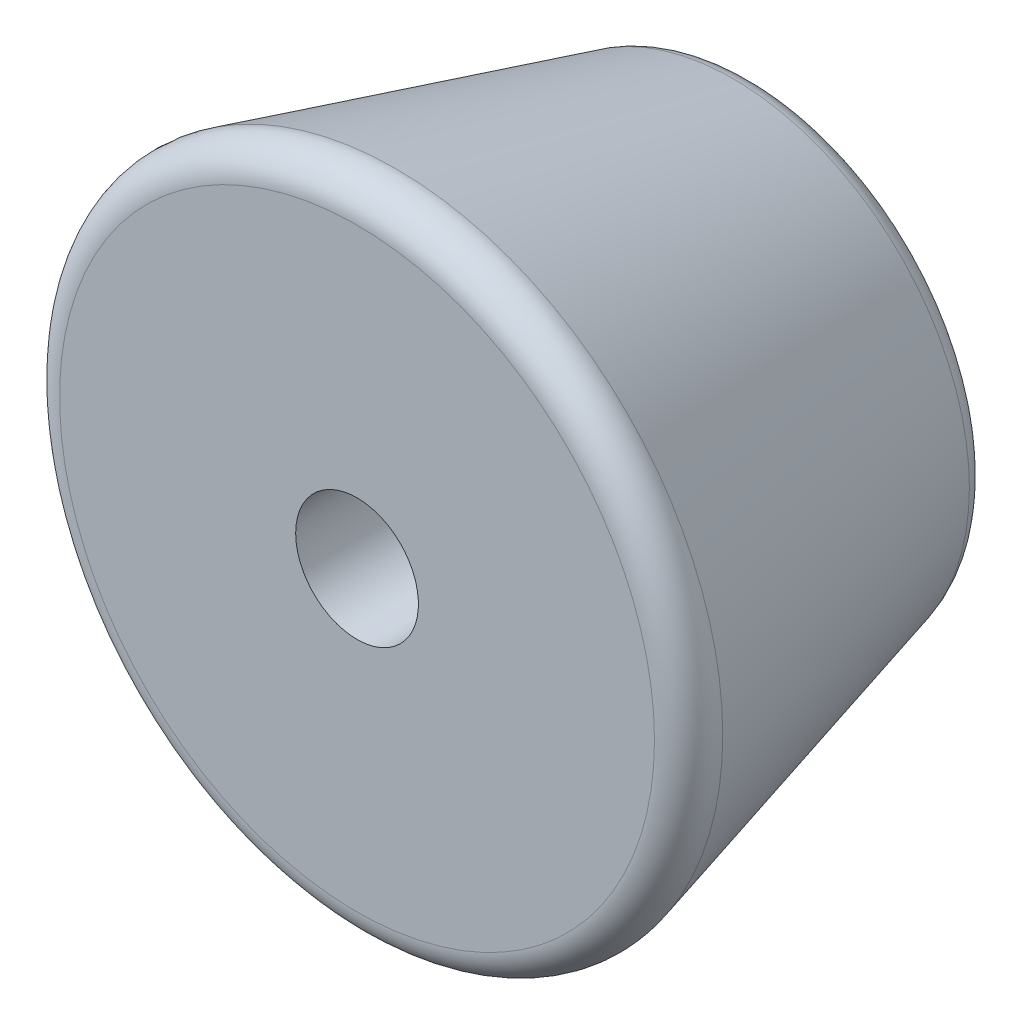
ISO-10303-21;
HEADER;
FILE_DESCRIPTION(('STEP AP214'),'2;1');
FILE_NAME('part.step','',(''),(''),'','','');
FILE_SCHEMA(('AUTOMOTIVE_DESIGN { 1 0 10303 214 1 1 1 1 }'));
ENDSEC;
DATA;
#1=APPLICATION_CONTEXT('core data for automotive mechanical design processes');
#2=APPLICATION_PROTOCOL_DEFINITION('international standard','automotive_design',2000,#1);
#3=PRODUCT_CONTEXT('',#1,'mechanical');
#4=PRODUCT('Part','Part','',(#3));
#5=PRODUCT_RELATED_PRODUCT_CATEGORY('part','',(#4));
#6=PRODUCT_DEFINITION_FORMATION('','',#4);
#7=PRODUCT_DEFINITION_CONTEXT('part definition',#1,'design');
#8=PRODUCT_DEFINITION('design','',#6,#7);
#9=PRODUCT_DEFINITION_SHAPE('','',#8);
#10=(LENGTH_UNIT() NAMED_UNIT(*) SI_UNIT(.MILLI.,.METRE.));
#11=(NAMED_UNIT(*) PLANE_ANGLE_UNIT() SI_UNIT($,.RADIAN.));
#12=(NAMED_UNIT(*) SI_UNIT($,.STERADIAN.) SOLID_ANGLE_UNIT());
#13=UNCERTAINTY_MEASURE_WITH_UNIT(LENGTH_MEASURE(1.E-05),#10,'distance_accuracy_value','');
#14=(GEOMETRIC_REPRESENTATION_CONTEXT(3) GLOBAL_UNCERTAINTY_ASSIGNED_CONTEXT((#13)) GLOBAL_UNIT_ASSIGNED_CONTEXT((#10,
#11,#12)) REPRESENTATION_CONTEXT('',''));
#15=CARTESIAN_POINT('',(0.,0.,0.));
#16=DIRECTION('',(0.,0.,1.));
#17=DIRECTION('',(1.,0.,0.));
#18=AXIS2_PLACEMENT_3D('',#15,#16,#17);
#19=CARTESIAN_POINT('',(11.,0.,0.));
#20=DIRECTION('',(0.,0.,1.));
#21=DIRECTION('',(1.,0.,0.));
#22=AXIS2_PLACEMENT_3D('',#19,#20,#21);
#23=PLANE('',#22);
#24=CARTESIAN_POINT('',(0.,0.,0.));
#25=DIRECTION('',(0.,0.,1.));
#26=DIRECTION('',(1.,0.,0.));
#27=AXIS2_PLACEMENT_3D('',#24,#25,#26);
#28=CIRCLE('',#27,9.69516061401259);
#29=CARTESIAN_POINT('',(9.69516061401259,0.,0.));
#30=VERTEX_POINT('',#29);
#31=EDGE_CURVE('E10',#30,#30,#28,.T.);
#32=ORIENTED_EDGE('',*,*,#31,.T.);
#33=EDGE_LOOP('',(#32));
#34=FACE_BOUND('',#33,.T.);
#35=CARTESIAN_POINT('',(0.,0.,0.));
#36=DIRECTION('',(0.,0.,-1.));
#37=DIRECTION('',(-1.,0.,0.));
#38=AXIS2_PLACEMENT_3D('',#35,#36,#37);
#39=CIRCLE('',#38,2.);
#40=CARTESIAN_POINT('',(-2.,0.,0.));
#41=VERTEX_POINT('',#40);
#42=EDGE_CURVE('E64',#41,#41,#39,.T.);
#43=ORIENTED_EDGE('',*,*,#42,.T.);
#44=EDGE_LOOP('',(#43));
#45=FACE_BOUND('',#44,.T.);
#46=ADVANCED_FACE('F35',(#34,#45),#23,.T.);
#47=CARTESIAN_POINT('',(0.,0.,-13.));
#48=DIRECTION('',(0.,0.,-1.));
#49=DIRECTION('',(-1.,0.,0.));
#50=AXIS2_PLACEMENT_3D('',#47,#48,#49);
#51=PLANE('',#50);
#52=CARTESIAN_POINT('',(0.,0.,-13.));
#53=DIRECTION('',(0.,0.,-1.));
#54=DIRECTION('',(-1.,0.,0.));
#55=AXIS2_PLACEMENT_3D('',#52,#53,#54);
#56=CIRCLE('',#55,6.73362215247413);
#57=CARTESIAN_POINT('',(-6.73362215247413,0.,-13.));
#58=VERTEX_POINT('',#57);
#59=EDGE_CURVE('E46',#58,#58,#56,.T.);
#60=ORIENTED_EDGE('',*,*,#59,.T.);
#61=EDGE_LOOP('',(#60));
#62=FACE_BOUND('',#61,.T.);
#63=CARTESIAN_POINT('',(0.,0.,-13.));
#64=DIRECTION('',(0.,0.,-1.));
#65=DIRECTION('',(-1.,0.,0.));
#66=AXIS2_PLACEMENT_3D('',#63,#64,#65);
#67=CIRCLE('',#66,6.);
#68=CARTESIAN_POINT('',(-6.,0.,-13.));
#69=VERTEX_POINT('',#68);
#70=EDGE_CURVE('E50',#69,#69,#67,.F.);
#71=ORIENTED_EDGE('',*,*,#70,.T.);
#72=EDGE_LOOP('',(#71));
#73=FACE_BOUND('',#72,.T.);
#74=ADVANCED_FACE('F92',(#62,#73),#51,.T.);
#75=CARTESIAN_POINT('',(0.,0.,0.));
#76=DIRECTION('',(0.,0.,1.));
#77=DIRECTION('',(1.,0.,0.));
#78=AXIS2_PLACEMENT_3D('',#75,#76,#77);
#79=CONICAL_SURFACE('',#78,11.,0.26299473168092);
#80=CARTESIAN_POINT('',(0.,0.,-12.2599734734479));
#81=DIRECTION('',(0.,0.,-1.));
#82=DIRECTION('',(-1.,0.,0.));
#83=AXIS2_PLACEMENT_3D('',#80,#81,#82);
#84=CIRCLE('',#83,7.69923791099481);
#85=CARTESIAN_POINT('',(-7.69923791099481,0.,-12.2599734734479));
#86=VERTEX_POINT('',#85);
#87=EDGE_CURVE('E55',#86,#86,#84,.F.);
#88=ORIENTED_EDGE('',*,*,#87,.T.);
#89=EDGE_LOOP('',(#88));
#90=FACE_BOUND('',#89,.T.);
#91=CARTESIAN_POINT('',(0.,0.,-1.25997347344787));
#92=DIRECTION('',(0.,0.,-1.));
#93=DIRECTION('',(-1.,0.,0.));
#94=AXIS2_PLACEMENT_3D('',#91,#92,#93);
#95=CIRCLE('',#94,10.6607763725333);
#96=CARTESIAN_POINT('',(-10.6607763725333,0.,-1.25997347344787));
#97=VERTEX_POINT('',#96);
#98=EDGE_CURVE('E58',#97,#97,#95,.T.);
#99=ORIENTED_EDGE('',*,*,#98,.T.);
#100=EDGE_LOOP('',(#99));
#101=FACE_BOUND('',#100,.T.);
#102=ADVANCED_FACE('F87',(#90,#101),#79,.T.);
#103=CARTESIAN_POINT('',(0.,0.,-6.));
#104=DIRECTION('',(0.,0.,-1.));
#105=DIRECTION('',(-1.,0.,0.));
#106=AXIS2_PLACEMENT_3D('',#103,#104,#105);
#107=CYLINDRICAL_SURFACE('',#106,5.);
#108=CARTESIAN_POINT('',(0.,0.,-12.));
#109=DIRECTION('',(0.,0.,-1.));
#110=DIRECTION('',(-1.,0.,0.));
#111=AXIS2_PLACEMENT_3D('',#108,#109,#110);
#112=CIRCLE('',#111,5.);
#113=CARTESIAN_POINT('',(-5.,0.,-12.));
#114=VERTEX_POINT('',#113);
#115=EDGE_CURVE('E42',#114,#114,#112,.T.);
#116=ORIENTED_EDGE('',*,*,#115,.T.);
#117=EDGE_LOOP('',(#116));
#118=FACE_BOUND('',#117,.T.);
#119=CARTESIAN_POINT('',(0.,0.,-6.));
#120=DIRECTION('',(0.,0.,-1.));
#121=DIRECTION('',(-1.,0.,0.));
#122=AXIS2_PLACEMENT_3D('',#119,#120,#121);
#123=CIRCLE('',#122,5.);
#124=CARTESIAN_POINT('',(-5.,0.,-6.));
#125=VERTEX_POINT('',#124);
#126=EDGE_CURVE('E61',#125,#125,#123,.T.);
#127=ORIENTED_EDGE('',*,*,#126,.F.);
#128=EDGE_LOOP('',(#127));
#129=FACE_BOUND('',#128,.T.);
#130=ADVANCED_FACE('F82',(#118,#129),#107,.F.);
#131=CARTESIAN_POINT('',(0.,0.,-6.));
#132=DIRECTION('',(0.,0.,-1.));
#133=DIRECTION('',(-1.,0.,0.));
#134=AXIS2_PLACEMENT_3D('',#131,#132,#133);
#135=PLANE('',#134);
#136=CARTESIAN_POINT('',(0.,0.,-6.));
#137=DIRECTION('',(0.,0.,-1.));
#138=DIRECTION('',(-1.,0.,0.));
#139=AXIS2_PLACEMENT_3D('',#136,#137,#138);
#140=CIRCLE('',#139,2.);
#141=CARTESIAN_POINT('',(-2.,0.,-6.));
#142=VERTEX_POINT('',#141);
#143=EDGE_CURVE('E65',#142,#142,#140,.T.);
#144=ORIENTED_EDGE('',*,*,#143,.F.);
#145=EDGE_LOOP('',(#144));
#146=FACE_BOUND('',#145,.T.);
#147=ORIENTED_EDGE('',*,*,#126,.T.);
#148=EDGE_LOOP('',(#147));
#149=FACE_BOUND('',#148,.T.);
#150=ADVANCED_FACE('F76',(#146,#149),#135,.T.);
#151=CARTESIAN_POINT('',(0.,0.,0.));
#152=DIRECTION('',(0.,0.,-1.));
#153=DIRECTION('',(-1.,0.,0.));
#154=AXIS2_PLACEMENT_3D('',#151,#152,#153);
#155=CYLINDRICAL_SURFACE('',#154,2.);
#156=ORIENTED_EDGE('',*,*,#42,.F.);
#157=EDGE_LOOP('',(#156));
#158=FACE_BOUND('',#157,.T.);
#159=ORIENTED_EDGE('',*,*,#143,.T.);
#160=EDGE_LOOP('',(#159));
#161=FACE_BOUND('',#160,.T.);
#162=ADVANCED_FACE('F72',(#158,#161),#155,.F.);
#163=CARTESIAN_POINT('',(0.,0.,-12.));
#164=DIRECTION('',(0.,0.,-1.));
#165=DIRECTION('',(-1.,0.,0.));
#166=AXIS2_PLACEMENT_3D('',#163,#164,#165);
#167=TOROIDAL_SURFACE('',#166,6.73362215247413,1.);
#168=ORIENTED_EDGE('',*,*,#59,.F.);
#169=EDGE_LOOP('',(#168));
#170=FACE_BOUND('',#169,.T.);
#171=ORIENTED_EDGE('',*,*,#87,.F.);
#172=EDGE_LOOP('',(#171));
#173=FACE_BOUND('',#172,.T.);
#174=ADVANCED_FACE('F75',(#170,#173),#167,.T.);
#175=CARTESIAN_POINT('',(0.,0.,-12.));
#176=DIRECTION('',(0.,0.,-1.));
#177=DIRECTION('',(-1.,0.,0.));
#178=AXIS2_PLACEMENT_3D('',#175,#176,#177);
#179=TOROIDAL_SURFACE('',#178,6.,1.);
#180=ORIENTED_EDGE('',*,*,#70,.F.);
#181=EDGE_LOOP('',(#180));
#182=FACE_BOUND('',#181,.T.);
#183=ORIENTED_EDGE('',*,*,#115,.F.);
#184=EDGE_LOOP('',(#183));
#185=FACE_BOUND('',#184,.T.);
#186=ADVANCED_FACE('F104',(#182,#185),#179,.T.);
#187=CARTESIAN_POINT('',(0.,0.,-1.));
#188=DIRECTION('',(0.,0.,1.));
#189=DIRECTION('',(1.,0.,0.));
#190=AXIS2_PLACEMENT_3D('',#187,#188,#189);
#191=TOROIDAL_SURFACE('',#190,9.69516061401259,1.);
#192=ORIENTED_EDGE('',*,*,#98,.F.);
#193=EDGE_LOOP('',(#192));
#194=FACE_BOUND('',#193,.T.);
#195=ORIENTED_EDGE('',*,*,#31,.F.);
#196=EDGE_LOOP('',(#195));
#197=FACE_BOUND('',#196,.T.);
#198=ADVANCED_FACE('F37',(#194,#197),#191,.T.);
#199=CLOSED_SHELL('',(#46,#74,#102,#130,#150,#162,#174,#186,#198));
#200=MANIFOLD_SOLID_BREP('B2',#199);
#201=ADVANCED_BREP_SHAPE_REPRESENTATION('',(#18,#200),#14);
#202=SHAPE_DEFINITION_REPRESENTATION(#9,#201);
ENDSEC;
END-ISO-10303-21;
